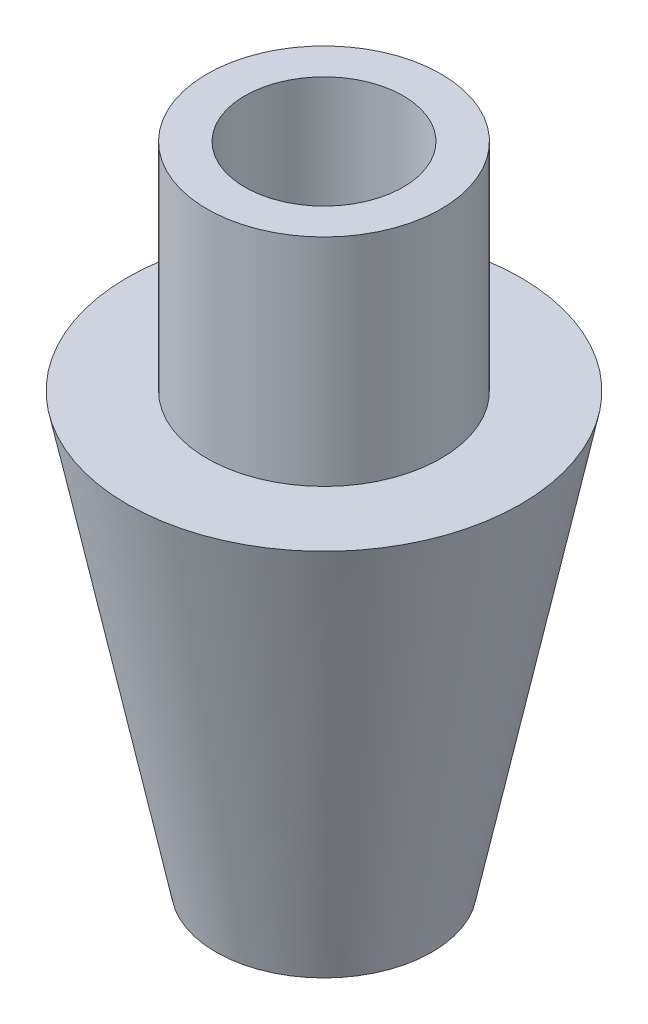
ISO-10303-21;
HEADER;
FILE_DESCRIPTION(('STEP AP214'),'2;1');
FILE_NAME('part.step','',(''),(''),'','','');
FILE_SCHEMA(('AUTOMOTIVE_DESIGN { 1 0 10303 214 1 1 1 1 }'));
ENDSEC;
DATA;
#1=APPLICATION_CONTEXT('core data for automotive mechanical design processes');
#2=APPLICATION_PROTOCOL_DEFINITION('international standard','automotive_design',2000,#1);
#3=PRODUCT_CONTEXT('',#1,'mechanical');
#4=PRODUCT('Part','Part','',(#3));
#5=PRODUCT_RELATED_PRODUCT_CATEGORY('part','',(#4));
#6=PRODUCT_DEFINITION_FORMATION('','',#4);
#7=PRODUCT_DEFINITION_CONTEXT('part definition',#1,'design');
#8=PRODUCT_DEFINITION('design','',#6,#7);
#9=PRODUCT_DEFINITION_SHAPE('','',#8);
#10=(LENGTH_UNIT() NAMED_UNIT(*) SI_UNIT(.MILLI.,.METRE.));
#11=(NAMED_UNIT(*) PLANE_ANGLE_UNIT() SI_UNIT($,.RADIAN.));
#12=(NAMED_UNIT(*) SI_UNIT($,.STERADIAN.) SOLID_ANGLE_UNIT());
#13=UNCERTAINTY_MEASURE_WITH_UNIT(LENGTH_MEASURE(1.E-05),#10,'distance_accuracy_value','');
#14=(GEOMETRIC_REPRESENTATION_CONTEXT(3) GLOBAL_UNCERTAINTY_ASSIGNED_CONTEXT((#13)) GLOBAL_UNIT_ASSIGNED_CONTEXT((#10,
#11,#12)) REPRESENTATION_CONTEXT('',''));
#15=CARTESIAN_POINT('',(0.,0.,0.));
#16=DIRECTION('',(0.,0.,1.));
#17=DIRECTION('',(1.,0.,0.));
#18=AXIS2_PLACEMENT_3D('',#15,#16,#17);
#19=CARTESIAN_POINT('',(0.,0.,0.));
#20=DIRECTION('',(0.,-1.,0.));
#21=DIRECTION('',(0.,0.,-1.));
#22=AXIS2_PLACEMENT_3D('',#19,#20,#21);
#23=CYLINDRICAL_SURFACE('',#22,13.716);
#24=CARTESIAN_POINT('',(0.,76.2,0.));
#25=DIRECTION('',(0.,-1.,0.));
#26=DIRECTION('',(0.,0.,-1.));
#27=AXIS2_PLACEMENT_3D('',#24,#25,#26);
#28=CIRCLE('',#27,13.716);
#29=CARTESIAN_POINT('',(0.,76.2,-13.716));
#30=VERTEX_POINT('',#29);
#31=EDGE_CURVE('E58',#30,#30,#28,.T.);
#32=ORIENTED_EDGE('',*,*,#31,.F.);
#33=EDGE_LOOP('',(#32));
#34=FACE_BOUND('',#33,.T.);
#35=CARTESIAN_POINT('',(0.,0.,0.));
#36=DIRECTION('',(0.,-1.,0.));
#37=DIRECTION('',(0.,0.,-1.));
#38=AXIS2_PLACEMENT_3D('',#35,#36,#37);
#39=CIRCLE('',#38,13.716);
#40=CARTESIAN_POINT('',(0.,0.,-13.716));
#41=VERTEX_POINT('',#40);
#42=EDGE_CURVE('E10',#41,#41,#39,.T.);
#43=ORIENTED_EDGE('',*,*,#42,.T.);
#44=EDGE_LOOP('',(#43));
#45=FACE_BOUND('',#44,.T.);
#46=ADVANCED_FACE('F30',(#34,#45),#23,.F.);
#47=CARTESIAN_POINT('',(0.,0.,13.716));
#48=DIRECTION('',(0.,1.,0.));
#49=DIRECTION('',(0.,0.,1.));
#50=AXIS2_PLACEMENT_3D('',#47,#48,#49);
#51=PLANE('',#50);
#52=ORIENTED_EDGE('',*,*,#42,.F.);
#53=EDGE_LOOP('',(#52));
#54=FACE_BOUND('',#53,.T.);
#55=CARTESIAN_POINT('',(0.,0.,0.));
#56=DIRECTION('',(0.,-1.,0.));
#57=DIRECTION('',(0.,0.,-1.));
#58=AXIS2_PLACEMENT_3D('',#55,#56,#57);
#59=CIRCLE('',#58,19.05);
#60=CARTESIAN_POINT('',(0.,0.,-19.05));
#61=VERTEX_POINT('',#60);
#62=EDGE_CURVE('E36',#61,#61,#59,.T.);
#63=ORIENTED_EDGE('',*,*,#62,.T.);
#64=EDGE_LOOP('',(#63));
#65=FACE_BOUND('',#64,.T.);
#66=ADVANCED_FACE('F65',(#54,#65),#51,.F.);
#67=CARTESIAN_POINT('',(0.,76.2,0.));
#68=DIRECTION('',(0.,1.,0.));
#69=DIRECTION('',(0.,0.,1.));
#70=AXIS2_PLACEMENT_3D('',#67,#68,#69);
#71=CONICAL_SURFACE('',#70,34.6583,0.202038646660735);
#72=ORIENTED_EDGE('',*,*,#62,.F.);
#73=EDGE_LOOP('',(#72));
#74=FACE_BOUND('',#73,.T.);
#75=CARTESIAN_POINT('',(0.,76.2,0.));
#76=DIRECTION('',(0.,-1.,0.));
#77=DIRECTION('',(0.,0.,-1.));
#78=AXIS2_PLACEMENT_3D('',#75,#76,#77);
#79=CIRCLE('',#78,34.6583);
#80=CARTESIAN_POINT('',(0.,76.2,-34.6583));
#81=VERTEX_POINT('',#80);
#82=EDGE_CURVE('E40',#81,#81,#79,.T.);
#83=ORIENTED_EDGE('',*,*,#82,.T.);
#84=EDGE_LOOP('',(#83));
#85=FACE_BOUND('',#84,.T.);
#86=ADVANCED_FACE('F69',(#74,#85),#71,.T.);
#87=CARTESIAN_POINT('',(0.,76.2,34.6583));
#88=DIRECTION('',(0.,-1.,0.));
#89=DIRECTION('',(0.,0.,-1.));
#90=AXIS2_PLACEMENT_3D('',#87,#88,#89);
#91=PLANE('',#90);
#92=ORIENTED_EDGE('',*,*,#82,.F.);
#93=EDGE_LOOP('',(#92));
#94=FACE_BOUND('',#93,.T.);
#95=CARTESIAN_POINT('',(0.,76.2,0.));
#96=DIRECTION('',(0.,-1.,0.));
#97=DIRECTION('',(0.,0.,-1.));
#98=AXIS2_PLACEMENT_3D('',#95,#96,#97);
#99=CIRCLE('',#98,20.6375);
#100=CARTESIAN_POINT('',(0.,76.2,-20.6375));
#101=VERTEX_POINT('',#100);
#102=EDGE_CURVE('E44',#101,#101,#99,.T.);
#103=ORIENTED_EDGE('',*,*,#102,.T.);
#104=EDGE_LOOP('',(#103));
#105=FACE_BOUND('',#104,.T.);
#106=ADVANCED_FACE('F74',(#94,#105),#91,.F.);
#107=CARTESIAN_POINT('',(0.,0.,0.));
#108=DIRECTION('',(0.,-1.,0.));
#109=DIRECTION('',(0.,0.,-1.));
#110=AXIS2_PLACEMENT_3D('',#107,#108,#109);
#111=CYLINDRICAL_SURFACE('',#110,20.6375);
#112=ORIENTED_EDGE('',*,*,#102,.F.);
#113=EDGE_LOOP('',(#112));
#114=FACE_BOUND('',#113,.T.);
#115=CARTESIAN_POINT('',(0.,114.3,0.));
#116=DIRECTION('',(0.,-1.,0.));
#117=DIRECTION('',(0.,0.,-1.));
#118=AXIS2_PLACEMENT_3D('',#115,#116,#117);
#119=CIRCLE('',#118,20.6375);
#120=CARTESIAN_POINT('',(0.,114.3,-20.6375));
#121=VERTEX_POINT('',#120);
#122=EDGE_CURVE('E49',#121,#121,#119,.T.);
#123=ORIENTED_EDGE('',*,*,#122,.T.);
#124=EDGE_LOOP('',(#123));
#125=FACE_BOUND('',#124,.T.);
#126=ADVANCED_FACE('F80',(#114,#125),#111,.T.);
#127=CARTESIAN_POINT('',(0.,114.3,20.6375));
#128=DIRECTION('',(0.,-1.,0.));
#129=DIRECTION('',(0.,0.,-1.));
#130=AXIS2_PLACEMENT_3D('',#127,#128,#129);
#131=PLANE('',#130);
#132=ORIENTED_EDGE('',*,*,#122,.F.);
#133=EDGE_LOOP('',(#132));
#134=FACE_BOUND('',#133,.T.);
#135=CARTESIAN_POINT('',(0.,114.3,0.));
#136=DIRECTION('',(0.,-1.,0.));
#137=DIRECTION('',(0.,0.,-1.));
#138=AXIS2_PLACEMENT_3D('',#135,#136,#137);
#139=CIRCLE('',#138,13.97);
#140=CARTESIAN_POINT('',(0.,114.3,-13.97));
#141=VERTEX_POINT('',#140);
#142=EDGE_CURVE('E52',#141,#141,#139,.T.);
#143=ORIENTED_EDGE('',*,*,#142,.T.);
#144=EDGE_LOOP('',(#143));
#145=FACE_BOUND('',#144,.T.);
#146=ADVANCED_FACE('F84',(#134,#145),#131,.F.);
#147=CARTESIAN_POINT('',(0.,0.,0.));
#148=DIRECTION('',(0.,-1.,0.));
#149=DIRECTION('',(0.,0.,-1.));
#150=AXIS2_PLACEMENT_3D('',#147,#148,#149);
#151=CYLINDRICAL_SURFACE('',#150,13.97);
#152=ORIENTED_EDGE('',*,*,#142,.F.);
#153=EDGE_LOOP('',(#152));
#154=FACE_BOUND('',#153,.T.);
#155=CARTESIAN_POINT('',(0.,76.2,0.));
#156=DIRECTION('',(0.,-1.,0.));
#157=DIRECTION('',(0.,0.,-1.));
#158=AXIS2_PLACEMENT_3D('',#155,#156,#157);
#159=CIRCLE('',#158,13.97);
#160=CARTESIAN_POINT('',(0.,76.2,-13.97));
#161=VERTEX_POINT('',#160);
#162=EDGE_CURVE('E55',#161,#161,#159,.T.);
#163=ORIENTED_EDGE('',*,*,#162,.T.);
#164=EDGE_LOOP('',(#163));
#165=FACE_BOUND('',#164,.T.);
#166=ADVANCED_FACE('F88',(#154,#165),#151,.F.);
#167=CARTESIAN_POINT('',(0.,76.2,13.97));
#168=DIRECTION('',(0.,-1.,0.));
#169=DIRECTION('',(0.,0.,-1.));
#170=AXIS2_PLACEMENT_3D('',#167,#168,#169);
#171=PLANE('',#170);
#172=ORIENTED_EDGE('',*,*,#162,.F.);
#173=EDGE_LOOP('',(#172));
#174=FACE_BOUND('',#173,.T.);
#175=ORIENTED_EDGE('',*,*,#31,.T.);
#176=EDGE_LOOP('',(#175));
#177=FACE_BOUND('',#176,.T.);
#178=ADVANCED_FACE('F62',(#174,#177),#171,.F.);
#179=CLOSED_SHELL('',(#46,#66,#86,#106,#126,#146,#166,#178));
#180=MANIFOLD_SOLID_BREP('B2',#179);
#181=ADVANCED_BREP_SHAPE_REPRESENTATION('',(#18,#180),#14);
#182=SHAPE_DEFINITION_REPRESENTATION(#9,#181);
ENDSEC;
END-ISO-10303-21;
